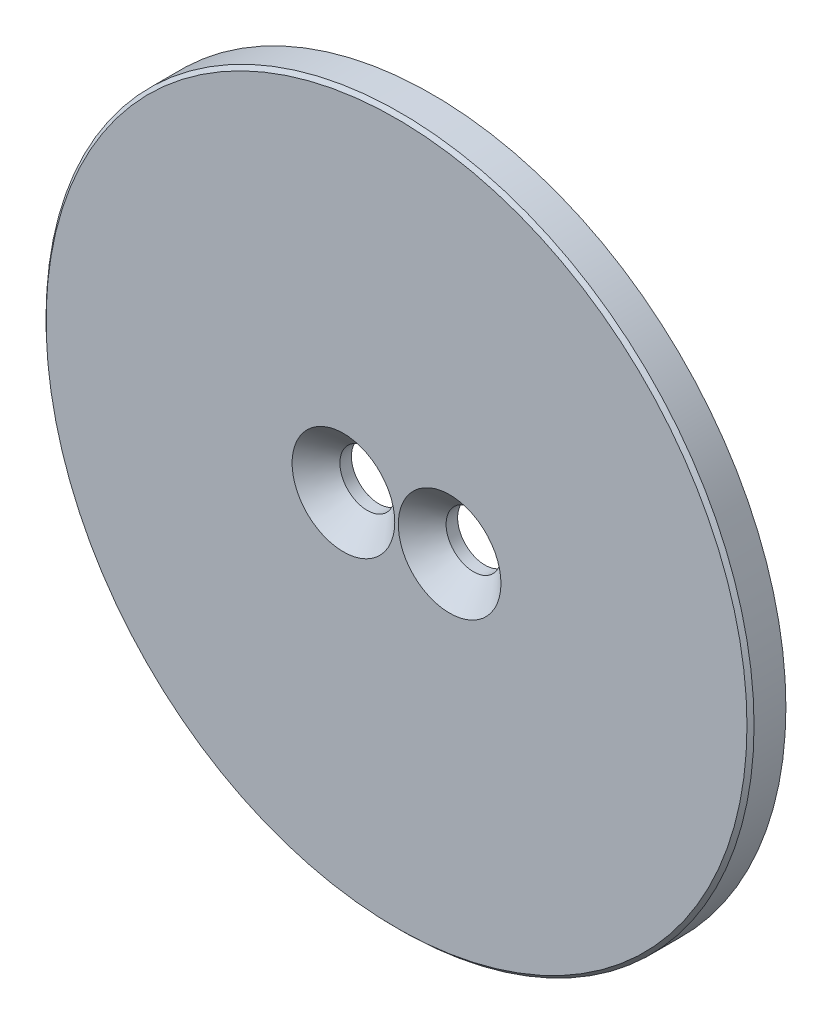
ISO-10303-21;
HEADER;
FILE_DESCRIPTION(('STEP AP214'),'2;1');
FILE_NAME('part.step','',(''),(''),'','','');
FILE_SCHEMA(('AUTOMOTIVE_DESIGN { 1 0 10303 214 1 1 1 1 }'));
ENDSEC;
DATA;
#1=APPLICATION_CONTEXT('core data for automotive mechanical design processes');
#2=APPLICATION_PROTOCOL_DEFINITION('international standard','automotive_design',2000,#1);
#3=PRODUCT_CONTEXT('',#1,'mechanical');
#4=PRODUCT('Part','Part','',(#3));
#5=PRODUCT_RELATED_PRODUCT_CATEGORY('part','',(#4));
#6=PRODUCT_DEFINITION_FORMATION('','',#4);
#7=PRODUCT_DEFINITION_CONTEXT('part definition',#1,'design');
#8=PRODUCT_DEFINITION('design','',#6,#7);
#9=PRODUCT_DEFINITION_SHAPE('','',#8);
#10=(LENGTH_UNIT() NAMED_UNIT(*) SI_UNIT(.MILLI.,.METRE.));
#11=(NAMED_UNIT(*) PLANE_ANGLE_UNIT() SI_UNIT($,.RADIAN.));
#12=(NAMED_UNIT(*) SI_UNIT($,.STERADIAN.) SOLID_ANGLE_UNIT());
#13=UNCERTAINTY_MEASURE_WITH_UNIT(LENGTH_MEASURE(1.E-05),#10,'distance_accuracy_value','');
#14=(GEOMETRIC_REPRESENTATION_CONTEXT(3) GLOBAL_UNCERTAINTY_ASSIGNED_CONTEXT((#13)) GLOBAL_UNIT_ASSIGNED_CONTEXT((#10,
#11,#12)) REPRESENTATION_CONTEXT('',''));
#15=CARTESIAN_POINT('',(0.,0.,0.));
#16=DIRECTION('',(0.,0.,1.));
#17=DIRECTION('',(1.,0.,0.));
#18=AXIS2_PLACEMENT_3D('',#15,#16,#17);
#19=CARTESIAN_POINT('',(0.,0.,2.));
#20=DIRECTION('',(0.,0.,-1.));
#21=DIRECTION('',(-1.,0.,0.));
#22=AXIS2_PLACEMENT_3D('',#19,#20,#21);
#23=CYLINDRICAL_SURFACE('',#22,20.);
#24=CARTESIAN_POINT('',(0.,0.,1.79999999999999));
#25=DIRECTION('',(0.,0.,1.));
#26=DIRECTION('',(1.,0.,0.));
#27=AXIS2_PLACEMENT_3D('',#24,#25,#26);
#28=CIRCLE('',#27,20.);
#29=CARTESIAN_POINT('',(20.,0.,1.79999999999999));
#30=VERTEX_POINT('',#29);
#31=EDGE_CURVE('E10',#30,#30,#28,.F.);
#32=ORIENTED_EDGE('',*,*,#31,.T.);
#33=EDGE_LOOP('',(#32));
#34=FACE_BOUND('',#33,.T.);
#35=CARTESIAN_POINT('',(0.,0.,0.));
#36=DIRECTION('',(0.,0.,1.));
#37=DIRECTION('',(1.,0.,0.));
#38=AXIS2_PLACEMENT_3D('',#35,#36,#37);
#39=CIRCLE('',#38,20.);
#40=CARTESIAN_POINT('',(20.,0.,0.));
#41=VERTEX_POINT('',#40);
#42=EDGE_CURVE('E43',#41,#41,#39,.T.);
#43=ORIENTED_EDGE('',*,*,#42,.T.);
#44=EDGE_LOOP('',(#43));
#45=FACE_BOUND('',#44,.T.);
#46=ADVANCED_FACE('F32',(#34,#45),#23,.T.);
#47=CARTESIAN_POINT('',(0.,0.,2.));
#48=DIRECTION('',(0.,0.,1.));
#49=DIRECTION('',(1.,0.,0.));
#50=AXIS2_PLACEMENT_3D('',#47,#48,#49);
#51=PLANE('',#50);
#52=CARTESIAN_POINT('',(0.,0.,2.));
#53=DIRECTION('',(0.,0.,1.));
#54=DIRECTION('',(1.,0.,0.));
#55=AXIS2_PLACEMENT_3D('',#52,#53,#54);
#56=CIRCLE('',#55,19.8);
#57=CARTESIAN_POINT('',(19.8,0.,2.));
#58=VERTEX_POINT('',#57);
#59=EDGE_CURVE('E39',#58,#58,#56,.T.);
#60=ORIENTED_EDGE('',*,*,#59,.T.);
#61=EDGE_LOOP('',(#60));
#62=FACE_BOUND('',#61,.T.);
#63=CARTESIAN_POINT('',(-3.,0.,2.));
#64=DIRECTION('',(0.,0.,1.));
#65=DIRECTION('',(1.,0.,0.));
#66=AXIS2_PLACEMENT_3D('',#63,#64,#65);
#67=CIRCLE('',#66,2.9);
#68=CARTESIAN_POINT('',(-0.1,0.,2.));
#69=VERTEX_POINT('',#68);
#70=EDGE_CURVE('E64',#69,#69,#67,.T.);
#71=ORIENTED_EDGE('',*,*,#70,.F.);
#72=EDGE_LOOP('',(#71));
#73=FACE_BOUND('',#72,.T.);
#74=CARTESIAN_POINT('',(3.,0.,2.));
#75=DIRECTION('',(0.,0.,1.));
#76=DIRECTION('',(1.,0.,0.));
#77=AXIS2_PLACEMENT_3D('',#74,#75,#76);
#78=CIRCLE('',#77,2.9);
#79=CARTESIAN_POINT('',(5.9,0.,2.));
#80=VERTEX_POINT('',#79);
#81=EDGE_CURVE('E58',#80,#80,#78,.T.);
#82=ORIENTED_EDGE('',*,*,#81,.F.);
#83=EDGE_LOOP('',(#82));
#84=FACE_BOUND('',#83,.T.);
#85=ADVANCED_FACE('F70',(#62,#73,#84),#51,.T.);
#86=CARTESIAN_POINT('',(0.,0.,0.));
#87=DIRECTION('',(0.,0.,1.));
#88=DIRECTION('',(1.,0.,0.));
#89=AXIS2_PLACEMENT_3D('',#86,#87,#88);
#90=PLANE('',#89);
#91=CARTESIAN_POINT('',(3.,0.,0.));
#92=DIRECTION('',(0.,0.,1.));
#93=DIRECTION('',(1.,0.,0.));
#94=AXIS2_PLACEMENT_3D('',#91,#92,#93);
#95=CIRCLE('',#94,1.55);
#96=CARTESIAN_POINT('',(4.55,0.,0.));
#97=VERTEX_POINT('',#96);
#98=EDGE_CURVE('E52',#97,#97,#95,.T.);
#99=ORIENTED_EDGE('',*,*,#98,.T.);
#100=EDGE_LOOP('',(#99));
#101=FACE_BOUND('',#100,.T.);
#102=CARTESIAN_POINT('',(-3.,0.,0.));
#103=DIRECTION('',(0.,0.,1.));
#104=DIRECTION('',(1.,0.,0.));
#105=AXIS2_PLACEMENT_3D('',#102,#103,#104);
#106=CIRCLE('',#105,1.55);
#107=CARTESIAN_POINT('',(-1.45,0.,0.));
#108=VERTEX_POINT('',#107);
#109=EDGE_CURVE('E47',#108,#108,#106,.T.);
#110=ORIENTED_EDGE('',*,*,#109,.T.);
#111=EDGE_LOOP('',(#110));
#112=FACE_BOUND('',#111,.T.);
#113=ORIENTED_EDGE('',*,*,#42,.F.);
#114=EDGE_LOOP('',(#113));
#115=FACE_BOUND('',#114,.T.);
#116=ADVANCED_FACE('F73',(#101,#112,#115),#90,.F.);
#117=CARTESIAN_POINT('',(-3.,0.,0.));
#118=DIRECTION('',(0.,0.,1.));
#119=DIRECTION('',(1.,0.,0.));
#120=AXIS2_PLACEMENT_3D('',#117,#118,#119);
#121=CYLINDRICAL_SURFACE('',#120,1.55);
#122=CARTESIAN_POINT('',(-3.,0.,0.65));
#123=DIRECTION('',(0.,0.,1.));
#124=DIRECTION('',(1.,0.,0.));
#125=AXIS2_PLACEMENT_3D('',#122,#123,#124);
#126=CIRCLE('',#125,1.55);
#127=CARTESIAN_POINT('',(-1.45,0.,0.65));
#128=VERTEX_POINT('',#127);
#129=EDGE_CURVE('E61',#128,#128,#126,.T.);
#130=ORIENTED_EDGE('',*,*,#129,.T.);
#131=EDGE_LOOP('',(#130));
#132=FACE_BOUND('',#131,.T.);
#133=ORIENTED_EDGE('',*,*,#109,.F.);
#134=EDGE_LOOP('',(#133));
#135=FACE_BOUND('',#134,.T.);
#136=ADVANCED_FACE('F88',(#132,#135),#121,.F.);
#137=CARTESIAN_POINT('',(3.,0.,0.));
#138=DIRECTION('',(0.,0.,1.));
#139=DIRECTION('',(1.,0.,0.));
#140=AXIS2_PLACEMENT_3D('',#137,#138,#139);
#141=CYLINDRICAL_SURFACE('',#140,1.55);
#142=CARTESIAN_POINT('',(3.,0.,0.65));
#143=DIRECTION('',(0.,0.,1.));
#144=DIRECTION('',(1.,0.,0.));
#145=AXIS2_PLACEMENT_3D('',#142,#143,#144);
#146=CIRCLE('',#145,1.55);
#147=CARTESIAN_POINT('',(4.55,0.,0.65));
#148=VERTEX_POINT('',#147);
#149=EDGE_CURVE('E55',#148,#148,#146,.T.);
#150=ORIENTED_EDGE('',*,*,#149,.T.);
#151=EDGE_LOOP('',(#150));
#152=FACE_BOUND('',#151,.T.);
#153=ORIENTED_EDGE('',*,*,#98,.F.);
#154=EDGE_LOOP('',(#153));
#155=FACE_BOUND('',#154,.T.);
#156=ADVANCED_FACE('F79',(#152,#155),#141,.F.);
#157=CARTESIAN_POINT('',(3.,0.,2.));
#158=DIRECTION('',(0.,0.,1.));
#159=DIRECTION('',(1.,0.,0.));
#160=AXIS2_PLACEMENT_3D('',#157,#158,#159);
#161=CONICAL_SURFACE('',#160,2.9,0.785398163397449);
#162=ORIENTED_EDGE('',*,*,#149,.F.);
#163=EDGE_LOOP('',(#162));
#164=FACE_BOUND('',#163,.T.);
#165=ORIENTED_EDGE('',*,*,#81,.T.);
#166=EDGE_LOOP('',(#165));
#167=FACE_BOUND('',#166,.T.);
#168=ADVANCED_FACE('F77',(#164,#167),#161,.F.);
#169=CARTESIAN_POINT('',(-3.,0.,2.));
#170=DIRECTION('',(0.,0.,1.));
#171=DIRECTION('',(1.,0.,0.));
#172=AXIS2_PLACEMENT_3D('',#169,#170,#171);
#173=CONICAL_SURFACE('',#172,2.9,0.785398163397449);
#174=ORIENTED_EDGE('',*,*,#129,.F.);
#175=EDGE_LOOP('',(#174));
#176=FACE_BOUND('',#175,.T.);
#177=ORIENTED_EDGE('',*,*,#70,.T.);
#178=EDGE_LOOP('',(#177));
#179=FACE_BOUND('',#178,.T.);
#180=ADVANCED_FACE('F68',(#176,#179),#173,.F.);
#181=CARTESIAN_POINT('',(0.,0.,2.));
#182=DIRECTION('',(0.,0.,-1.));
#183=DIRECTION('',(-1.,0.,0.));
#184=AXIS2_PLACEMENT_3D('',#181,#182,#183);
#185=CONICAL_SURFACE('',#184,19.8,0.785398163397448);
#186=ORIENTED_EDGE('',*,*,#31,.F.);
#187=EDGE_LOOP('',(#186));
#188=FACE_BOUND('',#187,.T.);
#189=ORIENTED_EDGE('',*,*,#59,.F.);
#190=EDGE_LOOP('',(#189));
#191=FACE_BOUND('',#190,.T.);
#192=ADVANCED_FACE('F34',(#188,#191),#185,.T.);
#193=CLOSED_SHELL('',(#46,#85,#116,#136,#156,#168,#180,#192));
#194=MANIFOLD_SOLID_BREP('B2',#193);
#195=ADVANCED_BREP_SHAPE_REPRESENTATION('',(#18,#194),#14);
#196=SHAPE_DEFINITION_REPRESENTATION(#9,#195);
ENDSEC;
END-ISO-10303-21;
